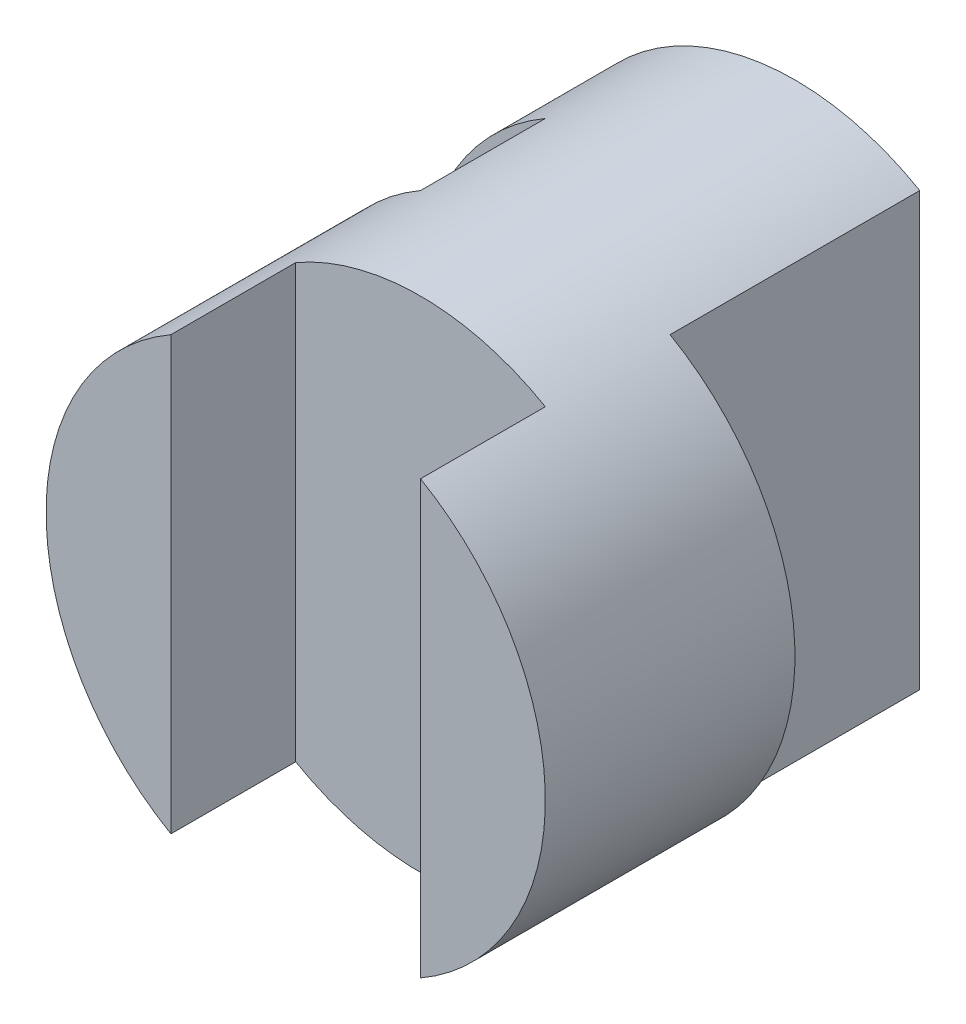
ISO-10303-21;
HEADER;
FILE_DESCRIPTION(('STEP AP214'),'2;1');
FILE_NAME('part.step','',(''),(''),'','','');
FILE_SCHEMA(('AUTOMOTIVE_DESIGN { 1 0 10303 214 1 1 1 1 }'));
ENDSEC;
DATA;
#1=APPLICATION_CONTEXT('core data for automotive mechanical design processes');
#2=APPLICATION_PROTOCOL_DEFINITION('international standard','automotive_design',2000,#1);
#3=PRODUCT_CONTEXT('',#1,'mechanical');
#4=PRODUCT('Part','Part','',(#3));
#5=PRODUCT_RELATED_PRODUCT_CATEGORY('part','',(#4));
#6=PRODUCT_DEFINITION_FORMATION('','',#4);
#7=PRODUCT_DEFINITION_CONTEXT('part definition',#1,'design');
#8=PRODUCT_DEFINITION('design','',#6,#7);
#9=PRODUCT_DEFINITION_SHAPE('','',#8);
#10=(LENGTH_UNIT() NAMED_UNIT(*) SI_UNIT(.MILLI.,.METRE.));
#11=(NAMED_UNIT(*) PLANE_ANGLE_UNIT() SI_UNIT($,.RADIAN.));
#12=(NAMED_UNIT(*) SI_UNIT($,.STERADIAN.) SOLID_ANGLE_UNIT());
#13=UNCERTAINTY_MEASURE_WITH_UNIT(LENGTH_MEASURE(1.E-05),#10,'distance_accuracy_value','');
#14=(GEOMETRIC_REPRESENTATION_CONTEXT(3) GLOBAL_UNCERTAINTY_ASSIGNED_CONTEXT((#13)) GLOBAL_UNIT_ASSIGNED_CONTEXT((#10,
#11,#12)) REPRESENTATION_CONTEXT('',''));
#15=CARTESIAN_POINT('',(0.,0.,0.));
#16=DIRECTION('',(0.,0.,1.));
#17=DIRECTION('',(1.,0.,0.));
#18=AXIS2_PLACEMENT_3D('',#15,#16,#17);
#19=CARTESIAN_POINT('',(0.,0.,4.));
#20=DIRECTION('',(0.,0.,1.));
#21=DIRECTION('',(1.,0.,0.));
#22=AXIS2_PLACEMENT_3D('',#19,#20,#21);
#23=PLANE('',#22);
#24=DIRECTION('',(0.,-1.,0.));
#25=VECTOR('',#24,1.);
#26=CARTESIAN_POINT('',(-1.,0.,4.));
#27=LINE('',#26,#25);
#28=CARTESIAN_POINT('',(-1.,1.73205080756888,4.));
#29=VERTEX_POINT('',#28);
#30=CARTESIAN_POINT('',(-1.,-1.73205080756888,4.));
#31=VERTEX_POINT('',#30);
#32=EDGE_CURVE('E129',#29,#31,#27,.T.);
#33=ORIENTED_EDGE('',*,*,#32,.F.);
#34=CARTESIAN_POINT('',(0.,0.,4.));
#35=DIRECTION('',(0.,0.,1.));
#36=DIRECTION('',(1.,0.,0.));
#37=AXIS2_PLACEMENT_3D('',#34,#35,#36);
#38=CIRCLE('',#37,2.);
#39=EDGE_CURVE('E111',#29,#31,#38,.T.);
#40=ORIENTED_EDGE('',*,*,#39,.T.);
#41=EDGE_LOOP('',(#33,#40));
#42=FACE_BOUND('',#41,.T.);
#43=ADVANCED_FACE('F33',(#42),#23,.T.);
#44=CARTESIAN_POINT('',(0.,0.,4.));
#45=DIRECTION('',(0.,0.,-1.));
#46=DIRECTION('',(-1.,0.,0.));
#47=AXIS2_PLACEMENT_3D('',#44,#45,#46);
#48=CYLINDRICAL_SURFACE('',#47,2.);
#49=CARTESIAN_POINT('',(0.,0.,1.));
#50=DIRECTION('',(0.,0.,-1.));
#51=DIRECTION('',(-1.,0.,0.));
#52=AXIS2_PLACEMENT_3D('',#49,#50,#51);
#53=CIRCLE('',#52,2.);
#54=CARTESIAN_POINT('',(-1.,-1.73205080756888,1.));
#55=VERTEX_POINT('',#54);
#56=CARTESIAN_POINT('',(-1.,1.73205080756888,1.));
#57=VERTEX_POINT('',#56);
#58=EDGE_CURVE('E140',#55,#57,#53,.T.);
#59=ORIENTED_EDGE('',*,*,#58,.T.);
#60=DIRECTION('',(0.,0.,-1.));
#61=VECTOR('',#60,1.);
#62=CARTESIAN_POINT('',(-0.999999999999999,1.73205080756888,4.));
#63=LINE('',#62,#61);
#64=CARTESIAN_POINT('',(-1.,1.73205080756888,2.));
#65=VERTEX_POINT('',#64);
#66=EDGE_CURVE('E134',#57,#65,#63,.F.);
#67=ORIENTED_EDGE('',*,*,#66,.T.);
#68=CARTESIAN_POINT('',(0.,0.,2.));
#69=DIRECTION('',(0.,0.,1.));
#70=DIRECTION('',(1.,0.,0.));
#71=AXIS2_PLACEMENT_3D('',#68,#69,#70);
#72=CIRCLE('',#71,2.);
#73=CARTESIAN_POINT('',(-1.,-1.73205080756888,2.));
#74=VERTEX_POINT('',#73);
#75=EDGE_CURVE('E131',#65,#74,#72,.T.);
#76=ORIENTED_EDGE('',*,*,#75,.T.);
#77=DIRECTION('',(0.,0.,-1.));
#78=VECTOR('',#77,1.);
#79=CARTESIAN_POINT('',(-0.999999999999999,-1.73205080756888,4.));
#80=LINE('',#79,#78);
#81=EDGE_CURVE('E137',#74,#55,#80,.T.);
#82=ORIENTED_EDGE('',*,*,#81,.T.);
#83=EDGE_LOOP('',(#59,#67,#76,#82));
#84=FACE_BOUND('',#83,.T.);
#85=CARTESIAN_POINT('',(0.,0.,3.));
#86=DIRECTION('',(0.,0.,-1.));
#87=DIRECTION('',(-1.,0.,0.));
#88=AXIS2_PLACEMENT_3D('',#85,#86,#87);
#89=CIRCLE('',#88,2.);
#90=CARTESIAN_POINT('',(1.,-1.73205080756888,3.));
#91=VERTEX_POINT('',#90);
#92=CARTESIAN_POINT('',(-1.,-1.73205080756888,3.));
#93=VERTEX_POINT('',#92);
#94=EDGE_CURVE('E11',#91,#93,#89,.T.);
#95=ORIENTED_EDGE('',*,*,#94,.T.);
#96=DIRECTION('',(0.,0.,-1.));
#97=VECTOR('',#96,1.);
#98=CARTESIAN_POINT('',(-1.,-1.73205080756888,4.));
#99=LINE('',#98,#97);
#100=EDGE_CURVE('E125',#93,#31,#99,.F.);
#101=ORIENTED_EDGE('',*,*,#100,.T.);
#102=ORIENTED_EDGE('',*,*,#39,.F.);
#103=DIRECTION('',(0.,0.,-1.));
#104=VECTOR('',#103,1.);
#105=CARTESIAN_POINT('',(-1.,1.73205080756888,4.));
#106=LINE('',#105,#104);
#107=CARTESIAN_POINT('',(-1.,1.73205080756888,3.));
#108=VERTEX_POINT('',#107);
#109=EDGE_CURVE('E120',#29,#108,#106,.T.);
#110=ORIENTED_EDGE('',*,*,#109,.T.);
#111=CARTESIAN_POINT('',(1.,1.73205080756888,3.));
#112=VERTEX_POINT('',#111);
#113=EDGE_CURVE('E37',#108,#112,#89,.T.);
#114=ORIENTED_EDGE('',*,*,#113,.T.);
#115=DIRECTION('',(0.,0.,-1.));
#116=VECTOR('',#115,1.);
#117=CARTESIAN_POINT('',(1.,1.73205080756888,4.));
#118=LINE('',#117,#116);
#119=CARTESIAN_POINT('',(1.,1.73205080756888,4.));
#120=VERTEX_POINT('',#119);
#121=EDGE_CURVE('E116',#112,#120,#118,.F.);
#122=ORIENTED_EDGE('',*,*,#121,.T.);
#123=CARTESIAN_POINT('',(1.,-1.73205080756888,4.));
#124=VERTEX_POINT('',#123);
#125=EDGE_CURVE('E119',#124,#120,#38,.T.);
#126=ORIENTED_EDGE('',*,*,#125,.F.);
#127=DIRECTION('',(0.,0.,-1.));
#128=VECTOR('',#127,1.);
#129=CARTESIAN_POINT('',(1.,-1.73205080756888,4.));
#130=LINE('',#129,#128);
#131=EDGE_CURVE('E55',#124,#91,#130,.T.);
#132=ORIENTED_EDGE('',*,*,#131,.T.);
#133=EDGE_LOOP('',(#95,#101,#102,#110,#114,#122,#126,#132));
#134=FACE_BOUND('',#133,.T.);
#135=CARTESIAN_POINT('',(0.,0.,2.));
#136=DIRECTION('',(0.,0.,1.));
#137=DIRECTION('',(1.,0.,0.));
#138=AXIS2_PLACEMENT_3D('',#135,#136,#137);
#139=CIRCLE('',#138,2.);
#140=CARTESIAN_POINT('',(1.,-1.73205080756888,2.));
#141=VERTEX_POINT('',#140);
#142=CARTESIAN_POINT('',(1.,1.73205080756888,2.));
#143=VERTEX_POINT('',#142);
#144=EDGE_CURVE('E115',#141,#143,#139,.T.);
#145=ORIENTED_EDGE('',*,*,#144,.T.);
#146=DIRECTION('',(0.,0.,-1.));
#147=VECTOR('',#146,1.);
#148=CARTESIAN_POINT('',(1.,1.73205080756888,4.));
#149=LINE('',#148,#147);
#150=CARTESIAN_POINT('',(1.,1.73205080756888,0.));
#151=VERTEX_POINT('',#150);
#152=EDGE_CURVE('E103',#143,#151,#149,.T.);
#153=ORIENTED_EDGE('',*,*,#152,.T.);
#154=CARTESIAN_POINT('',(0.,0.,0.));
#155=DIRECTION('',(0.,0.,1.));
#156=DIRECTION('',(1.,0.,0.));
#157=AXIS2_PLACEMENT_3D('',#154,#155,#156);
#158=CIRCLE('',#157,2.);
#159=CARTESIAN_POINT('',(1.,-1.73205080756888,0.));
#160=VERTEX_POINT('',#159);
#161=EDGE_CURVE('E114',#151,#160,#158,.T.);
#162=ORIENTED_EDGE('',*,*,#161,.T.);
#163=DIRECTION('',(0.,0.,-1.));
#164=VECTOR('',#163,1.);
#165=CARTESIAN_POINT('',(1.,-1.73205080756888,4.));
#166=LINE('',#165,#164);
#167=EDGE_CURVE('E106',#160,#141,#166,.F.);
#168=ORIENTED_EDGE('',*,*,#167,.T.);
#169=EDGE_LOOP('',(#145,#153,#162,#168));
#170=FACE_BOUND('',#169,.T.);
#171=ADVANCED_FACE('F35',(#84,#134,#170),#48,.T.);
#172=DIRECTION('',(0.,1.,0.));
#173=VECTOR('',#172,1.);
#174=CARTESIAN_POINT('',(1.,0.,4.));
#175=LINE('',#174,#173);
#176=EDGE_CURVE('E110',#124,#120,#175,.T.);
#177=ORIENTED_EDGE('',*,*,#176,.F.);
#178=ORIENTED_EDGE('',*,*,#125,.T.);
#179=EDGE_LOOP('',(#177,#178));
#180=FACE_BOUND('',#179,.T.);
#181=ADVANCED_FACE('F173',(#180),#23,.T.);
#182=CARTESIAN_POINT('',(0.,0.,0.));
#183=DIRECTION('',(0.,0.,1.));
#184=DIRECTION('',(1.,0.,0.));
#185=AXIS2_PLACEMENT_3D('',#182,#183,#184);
#186=PLANE('',#185);
#187=ORIENTED_EDGE('',*,*,#161,.F.);
#188=DIRECTION('',(0.,-1.,0.));
#189=VECTOR('',#188,1.);
#190=CARTESIAN_POINT('',(1.,0.,0.));
#191=LINE('',#190,#189);
#192=EDGE_CURVE('E99',#151,#160,#191,.T.);
#193=ORIENTED_EDGE('',*,*,#192,.T.);
#194=EDGE_LOOP('',(#187,#193));
#195=FACE_BOUND('',#194,.T.);
#196=ADVANCED_FACE('F118',(#195),#186,.F.);
#197=CARTESIAN_POINT('',(2.,-5.,2.));
#198=DIRECTION('',(0.,0.,1.));
#199=DIRECTION('',(1.,0.,0.));
#200=AXIS2_PLACEMENT_3D('',#197,#198,#199);
#201=PLANE('',#200);
#202=ORIENTED_EDGE('',*,*,#144,.F.);
#203=DIRECTION('',(0.,1.,0.));
#204=VECTOR('',#203,1.);
#205=CARTESIAN_POINT('',(1.,-5.,2.));
#206=LINE('',#205,#204);
#207=EDGE_CURVE('E157',#141,#143,#206,.T.);
#208=ORIENTED_EDGE('',*,*,#207,.T.);
#209=EDGE_LOOP('',(#202,#208));
#210=FACE_BOUND('',#209,.T.);
#211=ADVANCED_FACE('F184',(#210),#201,.F.);
#212=CARTESIAN_POINT('',(1.,-5.,0.));
#213=DIRECTION('',(-1.,0.,0.));
#214=DIRECTION('',(0.,0.,1.));
#215=AXIS2_PLACEMENT_3D('',#212,#213,#214);
#216=PLANE('',#215);
#217=ORIENTED_EDGE('',*,*,#207,.F.);
#218=ORIENTED_EDGE('',*,*,#167,.F.);
#219=ORIENTED_EDGE('',*,*,#192,.F.);
#220=ORIENTED_EDGE('',*,*,#152,.F.);
#221=EDGE_LOOP('',(#217,#218,#219,#220));
#222=FACE_BOUND('',#221,.T.);
#223=ADVANCED_FACE('F102',(#222),#216,.F.);
#224=CARTESIAN_POINT('',(-1.,-5.,3.));
#225=DIRECTION('',(0.,0.,-1.));
#226=DIRECTION('',(-1.,0.,0.));
#227=AXIS2_PLACEMENT_3D('',#224,#225,#226);
#228=PLANE('',#227);
#229=DIRECTION('',(0.,1.,0.));
#230=VECTOR('',#229,1.);
#231=CARTESIAN_POINT('',(-1.,-5.,3.));
#232=LINE('',#231,#230);
#233=EDGE_CURVE('E151',#93,#108,#232,.T.);
#234=ORIENTED_EDGE('',*,*,#233,.F.);
#235=ORIENTED_EDGE('',*,*,#94,.F.);
#236=DIRECTION('',(0.,1.,0.));
#237=VECTOR('',#236,1.);
#238=CARTESIAN_POINT('',(1.,-5.,3.));
#239=LINE('',#238,#237);
#240=EDGE_CURVE('E152',#91,#112,#239,.T.);
#241=ORIENTED_EDGE('',*,*,#240,.T.);
#242=ORIENTED_EDGE('',*,*,#113,.F.);
#243=EDGE_LOOP('',(#234,#235,#241,#242));
#244=FACE_BOUND('',#243,.T.);
#245=ADVANCED_FACE('F150',(#244),#228,.F.);
#246=CARTESIAN_POINT('',(-1.,-5.,4.));
#247=DIRECTION('',(-1.,0.,0.));
#248=DIRECTION('',(0.,0.,1.));
#249=AXIS2_PLACEMENT_3D('',#246,#247,#248);
#250=PLANE('',#249);
#251=ORIENTED_EDGE('',*,*,#32,.T.);
#252=ORIENTED_EDGE('',*,*,#100,.F.);
#253=ORIENTED_EDGE('',*,*,#233,.T.);
#254=ORIENTED_EDGE('',*,*,#109,.F.);
#255=EDGE_LOOP('',(#251,#252,#253,#254));
#256=FACE_BOUND('',#255,.T.);
#257=ADVANCED_FACE('F154',(#256),#250,.F.);
#258=CARTESIAN_POINT('',(1.,-5.,4.));
#259=DIRECTION('',(1.,0.,0.));
#260=DIRECTION('',(0.,0.,-1.));
#261=AXIS2_PLACEMENT_3D('',#258,#259,#260);
#262=PLANE('',#261);
#263=ORIENTED_EDGE('',*,*,#176,.T.);
#264=ORIENTED_EDGE('',*,*,#121,.F.);
#265=ORIENTED_EDGE('',*,*,#240,.F.);
#266=ORIENTED_EDGE('',*,*,#131,.F.);
#267=EDGE_LOOP('',(#263,#264,#265,#266));
#268=FACE_BOUND('',#267,.T.);
#269=ADVANCED_FACE('F185',(#268),#262,.F.);
#270=CARTESIAN_POINT('',(-2.,-5.,1.));
#271=DIRECTION('',(0.,0.,-1.));
#272=DIRECTION('',(-1.,0.,0.));
#273=AXIS2_PLACEMENT_3D('',#270,#271,#272);
#274=PLANE('',#273);
#275=ORIENTED_EDGE('',*,*,#58,.F.);
#276=DIRECTION('',(0.,1.,0.));
#277=VECTOR('',#276,1.);
#278=CARTESIAN_POINT('',(-1.,-5.,1.));
#279=LINE('',#278,#277);
#280=EDGE_CURVE('E162',#55,#57,#279,.T.);
#281=ORIENTED_EDGE('',*,*,#280,.T.);
#282=EDGE_LOOP('',(#275,#281));
#283=FACE_BOUND('',#282,.T.);
#284=ADVANCED_FACE('F187',(#283),#274,.F.);
#285=CARTESIAN_POINT('',(-1.,-5.,1.));
#286=DIRECTION('',(1.,0.,0.));
#287=DIRECTION('',(0.,0.,-1.));
#288=AXIS2_PLACEMENT_3D('',#285,#286,#287);
#289=PLANE('',#288);
#290=DIRECTION('',(0.,1.,0.));
#291=VECTOR('',#290,1.);
#292=CARTESIAN_POINT('',(-1.,-5.,2.));
#293=LINE('',#292,#291);
#294=EDGE_CURVE('E47',#74,#65,#293,.T.);
#295=ORIENTED_EDGE('',*,*,#294,.T.);
#296=ORIENTED_EDGE('',*,*,#66,.F.);
#297=ORIENTED_EDGE('',*,*,#280,.F.);
#298=ORIENTED_EDGE('',*,*,#81,.F.);
#299=EDGE_LOOP('',(#295,#296,#297,#298));
#300=FACE_BOUND('',#299,.T.);
#301=ADVANCED_FACE('F193',(#300),#289,.F.);
#302=CARTESIAN_POINT('',(-2.,-5.,2.));
#303=DIRECTION('',(0.,0.,1.));
#304=DIRECTION('',(1.,0.,0.));
#305=AXIS2_PLACEMENT_3D('',#302,#303,#304);
#306=PLANE('',#305);
#307=ORIENTED_EDGE('',*,*,#294,.F.);
#308=ORIENTED_EDGE('',*,*,#75,.F.);
#309=EDGE_LOOP('',(#307,#308));
#310=FACE_BOUND('',#309,.T.);
#311=ADVANCED_FACE('F201',(#310),#306,.F.);
#312=CLOSED_SHELL('',(#43,#171,#181,#196,#211,#223,#245,#257,#269,#284,#301,#311));
#313=MANIFOLD_SOLID_BREP('B2',#312);
#314=ADVANCED_BREP_SHAPE_REPRESENTATION('',(#18,#313),#14);
#315=SHAPE_DEFINITION_REPRESENTATION(#9,#314);
ENDSEC;
END-ISO-10303-21;
